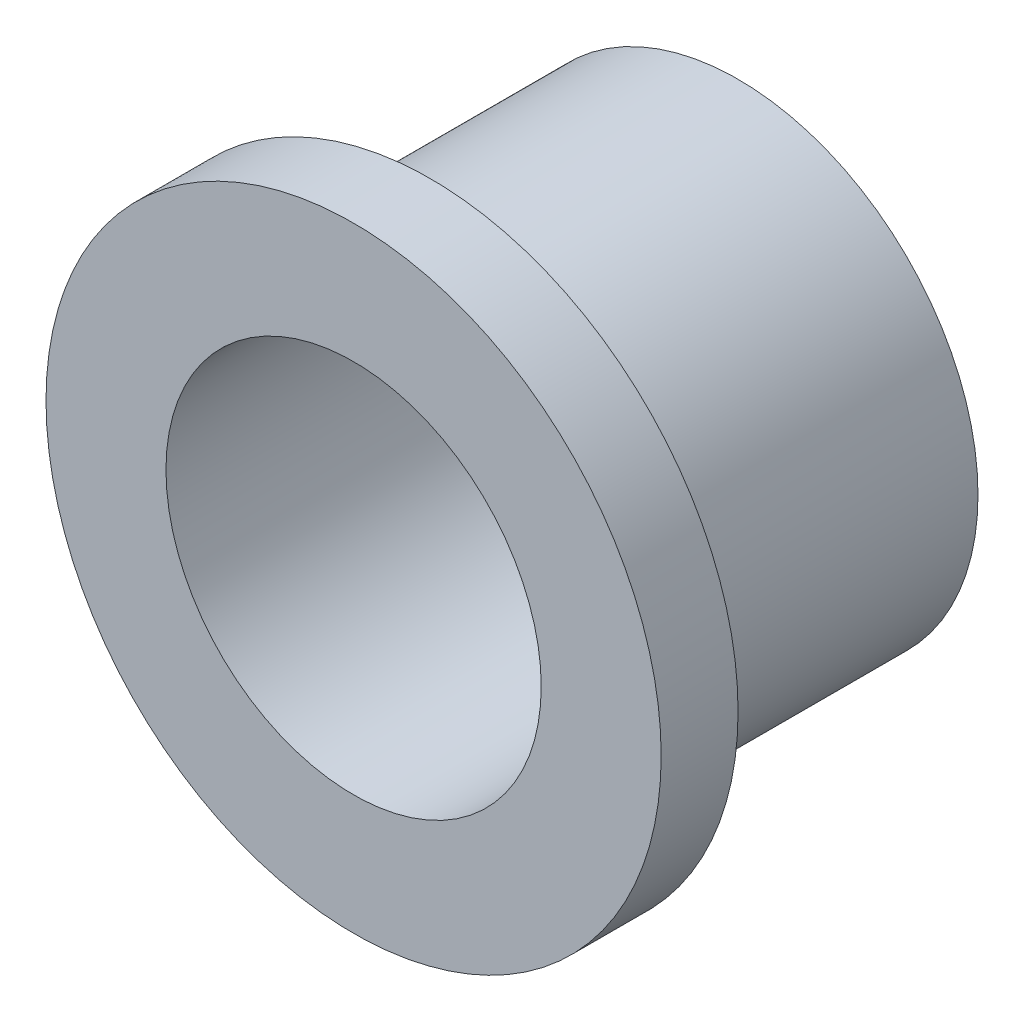
ISO-10303-21;
HEADER;
FILE_DESCRIPTION(('STEP AP214'),'2;1');
FILE_NAME('part.step','',(''),(''),'','','');
FILE_SCHEMA(('AUTOMOTIVE_DESIGN { 1 0 10303 214 1 1 1 1 }'));
ENDSEC;
DATA;
#1=APPLICATION_CONTEXT('core data for automotive mechanical design processes');
#2=APPLICATION_PROTOCOL_DEFINITION('international standard','automotive_design',2000,#1);
#3=PRODUCT_CONTEXT('',#1,'mechanical');
#4=PRODUCT('Part','Part','',(#3));
#5=PRODUCT_RELATED_PRODUCT_CATEGORY('part','',(#4));
#6=PRODUCT_DEFINITION_FORMATION('','',#4);
#7=PRODUCT_DEFINITION_CONTEXT('part definition',#1,'design');
#8=PRODUCT_DEFINITION('design','',#6,#7);
#9=PRODUCT_DEFINITION_SHAPE('','',#8);
#10=(LENGTH_UNIT() NAMED_UNIT(*) SI_UNIT(.MILLI.,.METRE.));
#11=(NAMED_UNIT(*) PLANE_ANGLE_UNIT() SI_UNIT($,.RADIAN.));
#12=(NAMED_UNIT(*) SI_UNIT($,.STERADIAN.) SOLID_ANGLE_UNIT());
#13=UNCERTAINTY_MEASURE_WITH_UNIT(LENGTH_MEASURE(1.E-05),#10,'distance_accuracy_value','');
#14=(GEOMETRIC_REPRESENTATION_CONTEXT(3) GLOBAL_UNCERTAINTY_ASSIGNED_CONTEXT((#13)) GLOBAL_UNIT_ASSIGNED_CONTEXT((#10,
#11,#12)) REPRESENTATION_CONTEXT('',''));
#15=CARTESIAN_POINT('',(0.,0.,0.));
#16=DIRECTION('',(0.,0.,1.));
#17=DIRECTION('',(1.,0.,0.));
#18=AXIS2_PLACEMENT_3D('',#15,#16,#17);
#19=CARTESIAN_POINT('',(0.,0.,5.));
#20=DIRECTION('',(0.,0.,-1.));
#21=DIRECTION('',(-1.,0.,0.));
#22=AXIS2_PLACEMENT_3D('',#19,#20,#21);
#23=CYLINDRICAL_SURFACE('',#22,3.9);
#24=CARTESIAN_POINT('',(0.,0.,5.));
#25=DIRECTION('',(0.,0.,1.));
#26=DIRECTION('',(1.,0.,0.));
#27=AXIS2_PLACEMENT_3D('',#24,#25,#26);
#28=CIRCLE('',#27,3.9);
#29=CARTESIAN_POINT('',(3.9,0.,5.));
#30=VERTEX_POINT('',#29);
#31=EDGE_CURVE('E10',#30,#30,#28,.T.);
#32=ORIENTED_EDGE('',*,*,#31,.F.);
#33=EDGE_LOOP('',(#32));
#34=FACE_BOUND('',#33,.T.);
#35=CARTESIAN_POINT('',(0.,0.,0.));
#36=DIRECTION('',(0.,0.,1.));
#37=DIRECTION('',(1.,0.,0.));
#38=AXIS2_PLACEMENT_3D('',#35,#36,#37);
#39=CIRCLE('',#38,3.9);
#40=CARTESIAN_POINT('',(3.9,0.,0.));
#41=VERTEX_POINT('',#40);
#42=EDGE_CURVE('E34',#41,#41,#39,.T.);
#43=ORIENTED_EDGE('',*,*,#42,.T.);
#44=EDGE_LOOP('',(#43));
#45=FACE_BOUND('',#44,.T.);
#46=ADVANCED_FACE('F31',(#34,#45),#23,.T.);
#47=CARTESIAN_POINT('',(0.,0.,0.));
#48=DIRECTION('',(0.,0.,1.));
#49=DIRECTION('',(1.,0.,0.));
#50=AXIS2_PLACEMENT_3D('',#47,#48,#49);
#51=PLANE('',#50);
#52=CARTESIAN_POINT('',(0.,0.,0.));
#53=DIRECTION('',(0.,0.,-1.));
#54=DIRECTION('',(-1.,0.,0.));
#55=AXIS2_PLACEMENT_3D('',#52,#53,#54);
#56=CIRCLE('',#55,3.05);
#57=CARTESIAN_POINT('',(-3.05,0.,0.));
#58=VERTEX_POINT('',#57);
#59=EDGE_CURVE('E49',#58,#58,#56,.T.);
#60=ORIENTED_EDGE('',*,*,#59,.F.);
#61=EDGE_LOOP('',(#60));
#62=FACE_BOUND('',#61,.T.);
#63=ORIENTED_EDGE('',*,*,#42,.F.);
#64=EDGE_LOOP('',(#63));
#65=FACE_BOUND('',#64,.T.);
#66=ADVANCED_FACE('F65',(#62,#65),#51,.F.);
#67=CARTESIAN_POINT('',(0.,0.,6.25));
#68=DIRECTION('',(0.,0.,-1.));
#69=DIRECTION('',(-1.,0.,0.));
#70=AXIS2_PLACEMENT_3D('',#67,#68,#69);
#71=CYLINDRICAL_SURFACE('',#70,5.);
#72=CARTESIAN_POINT('',(0.,0.,6.25));
#73=DIRECTION('',(0.,0.,1.));
#74=DIRECTION('',(1.,0.,0.));
#75=AXIS2_PLACEMENT_3D('',#72,#73,#74);
#76=CIRCLE('',#75,5.);
#77=CARTESIAN_POINT('',(5.,0.,6.25));
#78=VERTEX_POINT('',#77);
#79=EDGE_CURVE('E41',#78,#78,#76,.T.);
#80=ORIENTED_EDGE('',*,*,#79,.F.);
#81=EDGE_LOOP('',(#80));
#82=FACE_BOUND('',#81,.T.);
#83=CARTESIAN_POINT('',(0.,0.,5.));
#84=DIRECTION('',(0.,0.,1.));
#85=DIRECTION('',(1.,0.,0.));
#86=AXIS2_PLACEMENT_3D('',#83,#84,#85);
#87=CIRCLE('',#86,5.);
#88=CARTESIAN_POINT('',(5.,0.,5.));
#89=VERTEX_POINT('',#88);
#90=EDGE_CURVE('E43',#89,#89,#87,.T.);
#91=ORIENTED_EDGE('',*,*,#90,.T.);
#92=EDGE_LOOP('',(#91));
#93=FACE_BOUND('',#92,.T.);
#94=ADVANCED_FACE('F68',(#82,#93),#71,.T.);
#95=CARTESIAN_POINT('',(0.,0.,6.25));
#96=DIRECTION('',(0.,0.,1.));
#97=DIRECTION('',(1.,0.,0.));
#98=AXIS2_PLACEMENT_3D('',#95,#96,#97);
#99=PLANE('',#98);
#100=CARTESIAN_POINT('',(0.,0.,6.25));
#101=DIRECTION('',(0.,0.,-1.));
#102=DIRECTION('',(-1.,0.,0.));
#103=AXIS2_PLACEMENT_3D('',#100,#101,#102);
#104=CIRCLE('',#103,3.05);
#105=CARTESIAN_POINT('',(-3.05,0.,6.25));
#106=VERTEX_POINT('',#105);
#107=EDGE_CURVE('E46',#106,#106,#104,.T.);
#108=ORIENTED_EDGE('',*,*,#107,.T.);
#109=EDGE_LOOP('',(#108));
#110=FACE_BOUND('',#109,.T.);
#111=ORIENTED_EDGE('',*,*,#79,.T.);
#112=EDGE_LOOP('',(#111));
#113=FACE_BOUND('',#112,.T.);
#114=ADVANCED_FACE('F55',(#110,#113),#99,.T.);
#115=CARTESIAN_POINT('',(0.,0.,5.));
#116=DIRECTION('',(0.,0.,1.));
#117=DIRECTION('',(1.,0.,0.));
#118=AXIS2_PLACEMENT_3D('',#115,#116,#117);
#119=PLANE('',#118);
#120=ORIENTED_EDGE('',*,*,#31,.T.);
#121=EDGE_LOOP('',(#120));
#122=FACE_BOUND('',#121,.T.);
#123=ORIENTED_EDGE('',*,*,#90,.F.);
#124=EDGE_LOOP('',(#123));
#125=FACE_BOUND('',#124,.T.);
#126=ADVANCED_FACE('F61',(#122,#125),#119,.F.);
#127=CARTESIAN_POINT('',(0.,0.,6.25));
#128=DIRECTION('',(0.,0.,-1.));
#129=DIRECTION('',(-1.,0.,0.));
#130=AXIS2_PLACEMENT_3D('',#127,#128,#129);
#131=CYLINDRICAL_SURFACE('',#130,3.05);
#132=ORIENTED_EDGE('',*,*,#107,.F.);
#133=EDGE_LOOP('',(#132));
#134=FACE_BOUND('',#133,.T.);
#135=ORIENTED_EDGE('',*,*,#59,.T.);
#136=EDGE_LOOP('',(#135));
#137=FACE_BOUND('',#136,.T.);
#138=ADVANCED_FACE('F58',(#134,#137),#131,.F.);
#139=CLOSED_SHELL('',(#46,#66,#94,#114,#126,#138));
#140=MANIFOLD_SOLID_BREP('B2',#139);
#141=ADVANCED_BREP_SHAPE_REPRESENTATION('',(#18,#140),#14);
#142=SHAPE_DEFINITION_REPRESENTATION(#9,#141);
ENDSEC;
END-ISO-10303-21;
